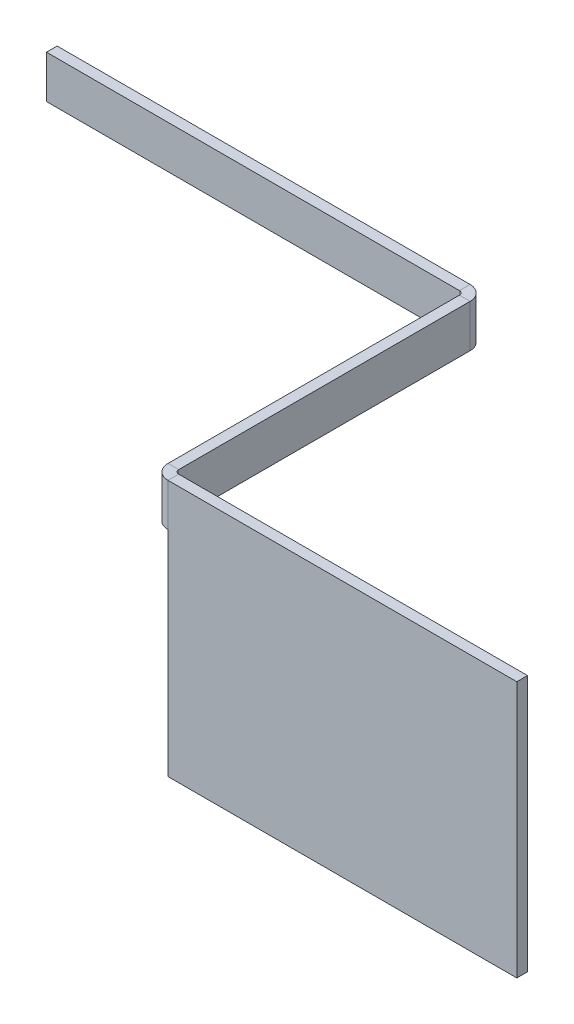
ISO-10303-21;
HEADER;
FILE_DESCRIPTION(('STEP AP214'),'2;1');
FILE_NAME('part.step','',(''),(''),'','','');
FILE_SCHEMA(('AUTOMOTIVE_DESIGN { 1 0 10303 214 1 1 1 1 }'));
ENDSEC;
DATA;
#1=APPLICATION_CONTEXT('core data for automotive mechanical design processes');
#2=APPLICATION_PROTOCOL_DEFINITION('international standard','automotive_design',2000,#1);
#3=PRODUCT_CONTEXT('',#1,'mechanical');
#4=PRODUCT('Part','Part','',(#3));
#5=PRODUCT_RELATED_PRODUCT_CATEGORY('part','',(#4));
#6=PRODUCT_DEFINITION_FORMATION('','',#4);
#7=PRODUCT_DEFINITION_CONTEXT('part definition',#1,'design');
#8=PRODUCT_DEFINITION('design','',#6,#7);
#9=PRODUCT_DEFINITION_SHAPE('','',#8);
#10=(LENGTH_UNIT() NAMED_UNIT(*) SI_UNIT(.MILLI.,.METRE.));
#11=(NAMED_UNIT(*) PLANE_ANGLE_UNIT() SI_UNIT($,.RADIAN.));
#12=(NAMED_UNIT(*) SI_UNIT($,.STERADIAN.) SOLID_ANGLE_UNIT());
#13=UNCERTAINTY_MEASURE_WITH_UNIT(LENGTH_MEASURE(1.E-05),#10,'distance_accuracy_value','');
#14=(GEOMETRIC_REPRESENTATION_CONTEXT(3) GLOBAL_UNCERTAINTY_ASSIGNED_CONTEXT((#13)) GLOBAL_UNIT_ASSIGNED_CONTEXT((#10,
#11,#12)) REPRESENTATION_CONTEXT('',''));
#15=CARTESIAN_POINT('',(0.,0.,0.));
#16=DIRECTION('',(0.,0.,1.));
#17=DIRECTION('',(1.,0.,0.));
#18=AXIS2_PLACEMENT_3D('',#15,#16,#17);
#19=CARTESIAN_POINT('',(-192.923759138241,-73.8089981998545,392.5));
#20=DIRECTION('',(0.,-1.,0.));
#21=DIRECTION('',(0.,0.,-1.));
#22=AXIS2_PLACEMENT_3D('',#19,#20,#21);
#23=PLANE('',#22);
#24=DIRECTION('',(1.,0.,0.));
#25=VECTOR('',#24,1.);
#26=CARTESIAN_POINT('',(-192.923759138241,-73.8089981998545,395.2366));
#27=LINE('',#26,#25);
#28=CARTESIAN_POINT('',(-192.923759138241,-73.8089981998545,395.2366));
#29=VERTEX_POINT('',#28);
#30=CARTESIAN_POINT('',(-190.923759138241,-73.8089981998545,395.2366));
#31=VERTEX_POINT('',#30);
#32=EDGE_CURVE('E270',#29,#31,#27,.T.);
#33=ORIENTED_EDGE('',*,*,#32,.F.);
#34=DIRECTION('',(0.,0.,-1.));
#35=VECTOR('',#34,1.);
#36=CARTESIAN_POINT('',(-192.923759138242,-73.8089981998548,7.7715611723761E-13));
#37=LINE('',#36,#35);
#38=CARTESIAN_POINT('',(-192.923759138241,-73.8089981998544,449.763400000001));
#39=VERTEX_POINT('',#38);
#40=EDGE_CURVE('E102',#39,#29,#37,.T.);
#41=ORIENTED_EDGE('',*,*,#40,.F.);
#42=DIRECTION('',(-1.,0.,0.));
#43=VECTOR('',#42,1.);
#44=CARTESIAN_POINT('',(-190.923759138241,-73.8089981998544,449.763400000001));
#45=LINE('',#44,#43);
#46=CARTESIAN_POINT('',(-190.923759138241,-73.8089981998544,449.763400000001));
#47=VERTEX_POINT('',#46);
#48=EDGE_CURVE('E275',#47,#39,#45,.T.);
#49=ORIENTED_EDGE('',*,*,#48,.F.);
#50=DIRECTION('',(0.,0.,1.));
#51=VECTOR('',#50,1.);
#52=CARTESIAN_POINT('',(-190.923759138241,-73.8089981998545,392.5));
#53=LINE('',#52,#51);
#54=EDGE_CURVE('E259',#47,#31,#53,.F.);
#55=ORIENTED_EDGE('',*,*,#54,.T.);
#56=EDGE_LOOP('',(#33,#41,#49,#55));
#57=FACE_BOUND('',#56,.T.);
#58=ADVANCED_FACE('F78',(#57),#23,.F.);
#59=CARTESIAN_POINT('',(-192.923759138242,0.,6.66133814775094E-13));
#60=DIRECTION('',(1.,0.,0.));
#61=DIRECTION('',(0.,0.,-1.));
#62=AXIS2_PLACEMENT_3D('',#59,#60,#61);
#63=PLANE('',#62);
#64=DIRECTION('',(0.,1.,0.));
#65=VECTOR('',#64,1.);
#66=CARTESIAN_POINT('',(-192.923759138241,-121.808998199854,395.2366));
#67=LINE('',#66,#65);
#68=CARTESIAN_POINT('',(-192.923759138241,-81.8089981998545,395.2366));
#69=VERTEX_POINT('',#68);
#70=EDGE_CURVE('E267',#69,#29,#67,.T.);
#71=ORIENTED_EDGE('',*,*,#70,.F.);
#72=DIRECTION('',(0.,0.,-1.));
#73=VECTOR('',#72,1.);
#74=CARTESIAN_POINT('',(-192.923759138241,-81.8089981998545,452.491244901112));
#75=LINE('',#74,#73);
#76=CARTESIAN_POINT('',(-192.923759138241,-81.8089981998545,449.763400000001));
#77=VERTEX_POINT('',#76);
#78=EDGE_CURVE('E82',#77,#69,#75,.T.);
#79=ORIENTED_EDGE('',*,*,#78,.F.);
#80=DIRECTION('',(0.,-1.,0.));
#81=VECTOR('',#80,1.);
#82=CARTESIAN_POINT('',(-192.923759138241,-121.808998199854,449.763400000001));
#83=LINE('',#82,#81);
#84=EDGE_CURVE('E87',#39,#77,#83,.T.);
#85=ORIENTED_EDGE('',*,*,#84,.F.);
#86=ORIENTED_EDGE('',*,*,#40,.T.);
#87=EDGE_LOOP('',(#71,#79,#85,#86));
#88=FACE_BOUND('',#87,.T.);
#89=ADVANCED_FACE('F283',(#88),#63,.F.);
#90=CARTESIAN_POINT('',(-190.923759138242,0.,6.66133814775094E-13));
#91=DIRECTION('',(1.,0.,0.));
#92=DIRECTION('',(0.,0.,-1.));
#93=AXIS2_PLACEMENT_3D('',#90,#91,#92);
#94=PLANE('',#93);
#95=DIRECTION('',(0.,0.,1.));
#96=VECTOR('',#95,1.);
#97=CARTESIAN_POINT('',(-190.923759138241,-81.8089981998545,452.491244901112));
#98=LINE('',#97,#96);
#99=CARTESIAN_POINT('',(-190.923759138241,-81.8089981998545,395.2366));
#100=VERTEX_POINT('',#99);
#101=CARTESIAN_POINT('',(-190.923759138241,-81.8089981998545,449.763400000001));
#102=VERTEX_POINT('',#101);
#103=EDGE_CURVE('E261',#100,#102,#98,.T.);
#104=ORIENTED_EDGE('',*,*,#103,.F.);
#105=DIRECTION('',(0.,1.,0.));
#106=VECTOR('',#105,1.);
#107=CARTESIAN_POINT('',(-190.923759138241,-121.808998199854,395.2366));
#108=LINE('',#107,#106);
#109=EDGE_CURVE('E258',#100,#31,#108,.T.);
#110=ORIENTED_EDGE('',*,*,#109,.T.);
#111=ORIENTED_EDGE('',*,*,#54,.F.);
#112=DIRECTION('',(0.,1.,0.));
#113=VECTOR('',#112,1.);
#114=CARTESIAN_POINT('',(-190.923759138241,-121.808998199854,449.763400000001));
#115=LINE('',#114,#113);
#116=EDGE_CURVE('E273',#102,#47,#115,.T.);
#117=ORIENTED_EDGE('',*,*,#116,.F.);
#118=EDGE_LOOP('',(#104,#110,#111,#117));
#119=FACE_BOUND('',#118,.T.);
#120=ADVANCED_FACE('F314',(#119),#94,.T.);
#121=CARTESIAN_POINT('',(-47.9677020171653,-81.8089981998545,452.491244901113));
#122=DIRECTION('',(0.,1.,0.));
#123=DIRECTION('',(0.,0.,-1.));
#124=AXIS2_PLACEMENT_3D('',#121,#122,#123);
#125=PLANE('',#124);
#126=DIRECTION('',(1.,0.,0.));
#127=VECTOR('',#126,1.);
#128=CARTESIAN_POINT('',(-192.923759138241,-81.8089981998545,449.763400000001));
#129=LINE('',#128,#127);
#130=EDGE_CURVE('E13',#77,#102,#129,.T.);
#131=ORIENTED_EDGE('',*,*,#130,.F.);
#132=ORIENTED_EDGE('',*,*,#78,.T.);
#133=DIRECTION('',(-1.,0.,0.));
#134=VECTOR('',#133,1.);
#135=CARTESIAN_POINT('',(-190.923759138241,-81.8089981998545,395.2366));
#136=LINE('',#135,#134);
#137=EDGE_CURVE('E264',#100,#69,#136,.T.);
#138=ORIENTED_EDGE('',*,*,#137,.F.);
#139=ORIENTED_EDGE('',*,*,#103,.T.);
#140=EDGE_LOOP('',(#131,#132,#138,#139));
#141=FACE_BOUND('',#140,.T.);
#142=ADVANCED_FACE('F80',(#141),#125,.F.);
#143=CARTESIAN_POINT('',(-193.660359138241,-81.8089981998545,395.2366));
#144=DIRECTION('',(0.,-1.,0.));
#145=DIRECTION('',(1.,0.,0.));
#146=AXIS2_PLACEMENT_3D('',#143,#144,#145);
#147=PLANE('',#146);
#148=ORIENTED_EDGE('',*,*,#137,.T.);
#149=CARTESIAN_POINT('',(-193.660359138241,-81.8089981998545,395.2366));
#150=DIRECTION('',(0.,1.,0.));
#151=DIRECTION('',(-1.,0.,0.));
#152=AXIS2_PLACEMENT_3D('',#149,#150,#151);
#153=CIRCLE('',#152,0.7366);
#154=CARTESIAN_POINT('',(-193.660359138241,-81.8089981998545,394.5));
#155=VERTEX_POINT('',#154);
#156=EDGE_CURVE('E217',#69,#155,#153,.T.);
#157=ORIENTED_EDGE('',*,*,#156,.T.);
#158=DIRECTION('',(0.,0.,-1.));
#159=VECTOR('',#158,1.);
#160=CARTESIAN_POINT('',(-193.660359138241,-81.8089981998545,394.5));
#161=LINE('',#160,#159);
#162=CARTESIAN_POINT('',(-193.660359138241,-81.8089981998545,392.5));
#163=VERTEX_POINT('',#162);
#164=EDGE_CURVE('E237',#155,#163,#161,.T.);
#165=ORIENTED_EDGE('',*,*,#164,.T.);
#166=CARTESIAN_POINT('',(-193.660359138241,-81.8089981998545,395.2366));
#167=DIRECTION('',(0.,1.,0.));
#168=DIRECTION('',(1.,0.,0.));
#169=AXIS2_PLACEMENT_3D('',#166,#167,#168);
#170=CIRCLE('',#169,2.73659999999999);
#171=EDGE_CURVE('E246',#100,#163,#170,.T.);
#172=ORIENTED_EDGE('',*,*,#171,.F.);
#173=EDGE_LOOP('',(#148,#157,#165,#172));
#174=FACE_BOUND('',#173,.T.);
#175=ADVANCED_FACE('F288',(#174),#147,.T.);
#176=CARTESIAN_POINT('',(-193.660359138241,-73.8089981998545,395.2366));
#177=DIRECTION('',(0.,1.,0.));
#178=DIRECTION('',(-1.,0.,0.));
#179=AXIS2_PLACEMENT_3D('',#176,#177,#178);
#180=PLANE('',#179);
#181=DIRECTION('',(0.,0.,-1.));
#182=VECTOR('',#181,1.);
#183=CARTESIAN_POINT('',(-193.660359138241,-73.8089981998545,392.5));
#184=LINE('',#183,#182);
#185=CARTESIAN_POINT('',(-193.660359138241,-73.8089981998545,394.5));
#186=VERTEX_POINT('',#185);
#187=CARTESIAN_POINT('',(-193.660359138241,-73.8089981998545,392.5));
#188=VERTEX_POINT('',#187);
#189=EDGE_CURVE('E221',#186,#188,#184,.T.);
#190=ORIENTED_EDGE('',*,*,#189,.F.);
#191=CARTESIAN_POINT('',(-193.660359138241,-73.8089981998545,395.2366));
#192=DIRECTION('',(0.,1.,0.));
#193=DIRECTION('',(-1.,0.,0.));
#194=AXIS2_PLACEMENT_3D('',#191,#192,#193);
#195=CIRCLE('',#194,0.7366);
#196=EDGE_CURVE('E250',#186,#29,#195,.F.);
#197=ORIENTED_EDGE('',*,*,#196,.T.);
#198=ORIENTED_EDGE('',*,*,#32,.T.);
#199=CARTESIAN_POINT('',(-193.660359138241,-73.8089981998545,395.2366));
#200=DIRECTION('',(0.,-1.,0.));
#201=DIRECTION('',(1.,0.,0.));
#202=AXIS2_PLACEMENT_3D('',#199,#200,#201);
#203=CIRCLE('',#202,2.73659999999999);
#204=EDGE_CURVE('E249',#188,#31,#203,.T.);
#205=ORIENTED_EDGE('',*,*,#204,.F.);
#206=EDGE_LOOP('',(#190,#197,#198,#205));
#207=FACE_BOUND('',#206,.T.);
#208=ADVANCED_FACE('F300',(#207),#180,.T.);
#209=CARTESIAN_POINT('',(-193.660359138241,-86.4946839991753,395.2366));
#210=DIRECTION('',(0.,1.,0.));
#211=DIRECTION('',(-1.,0.,0.));
#212=AXIS2_PLACEMENT_3D('',#209,#210,#211);
#213=CYLINDRICAL_SURFACE('',#212,2.7366);
#214=ORIENTED_EDGE('',*,*,#204,.T.);
#215=ORIENTED_EDGE('',*,*,#109,.F.);
#216=ORIENTED_EDGE('',*,*,#171,.T.);
#217=DIRECTION('',(0.,1.,0.));
#218=VECTOR('',#217,1.);
#219=CARTESIAN_POINT('',(-193.660359138241,-73.8089981998545,392.5));
#220=LINE('',#219,#218);
#221=EDGE_CURVE('E243',#163,#188,#220,.T.);
#222=ORIENTED_EDGE('',*,*,#221,.T.);
#223=EDGE_LOOP('',(#214,#215,#216,#222));
#224=FACE_BOUND('',#223,.T.);
#225=ADVANCED_FACE('F311',(#224),#213,.T.);
#226=CARTESIAN_POINT('',(-193.660359138241,-86.4946839991753,395.2366));
#227=DIRECTION('',(0.,1.,0.));
#228=DIRECTION('',(-1.,0.,0.));
#229=AXIS2_PLACEMENT_3D('',#226,#227,#228);
#230=CYLINDRICAL_SURFACE('',#229,0.7366);
#231=ORIENTED_EDGE('',*,*,#196,.F.);
#232=DIRECTION('',(0.,-1.,0.));
#233=VECTOR('',#232,1.);
#234=CARTESIAN_POINT('',(-193.660359138241,-73.8089981998545,394.5));
#235=LINE('',#234,#233);
#236=EDGE_CURVE('E240',#186,#155,#235,.T.);
#237=ORIENTED_EDGE('',*,*,#236,.T.);
#238=ORIENTED_EDGE('',*,*,#156,.F.);
#239=ORIENTED_EDGE('',*,*,#70,.T.);
#240=EDGE_LOOP('',(#231,#237,#238,#239));
#241=FACE_BOUND('',#240,.T.);
#242=ADVANCED_FACE('F290',(#241),#230,.F.);
#243=CARTESIAN_POINT('',(-270.923759138241,-73.8089981998545,392.5));
#244=DIRECTION('',(1.,0.,0.));
#245=DIRECTION('',(0.,0.,-1.));
#246=AXIS2_PLACEMENT_3D('',#243,#244,#245);
#247=PLANE('',#246);
#248=DIRECTION('',(0.,1.,0.));
#249=VECTOR('',#248,1.);
#250=CARTESIAN_POINT('',(-270.923759138241,0.,392.5));
#251=LINE('',#250,#249);
#252=CARTESIAN_POINT('',(-270.923759138241,-81.8089981998545,392.5));
#253=VERTEX_POINT('',#252);
#254=CARTESIAN_POINT('',(-270.923759138241,-73.8089981998545,392.5));
#255=VERTEX_POINT('',#254);
#256=EDGE_CURVE('E230',#253,#255,#251,.T.);
#257=ORIENTED_EDGE('',*,*,#256,.F.);
#258=DIRECTION('',(0.,0.,1.));
#259=VECTOR('',#258,1.);
#260=CARTESIAN_POINT('',(-270.923759138241,-81.8089981998545,249.543942878925));
#261=LINE('',#260,#259);
#262=CARTESIAN_POINT('',(-270.923759138241,-81.8089981998545,394.5));
#263=VERTEX_POINT('',#262);
#264=EDGE_CURVE('E234',#253,#263,#261,.T.);
#265=ORIENTED_EDGE('',*,*,#264,.T.);
#266=DIRECTION('',(0.,-1.,0.));
#267=VECTOR('',#266,1.);
#268=CARTESIAN_POINT('',(-270.923759138241,-73.8089981998545,394.5));
#269=LINE('',#268,#267);
#270=CARTESIAN_POINT('',(-270.923759138241,-73.8089981998545,394.5));
#271=VERTEX_POINT('',#270);
#272=EDGE_CURVE('E232',#263,#271,#269,.F.);
#273=ORIENTED_EDGE('',*,*,#272,.T.);
#274=DIRECTION('',(0.,0.,1.));
#275=VECTOR('',#274,1.);
#276=CARTESIAN_POINT('',(-270.923759138241,-73.8089981998545,392.5));
#277=LINE('',#276,#275);
#278=EDGE_CURVE('E218',#255,#271,#277,.T.);
#279=ORIENTED_EDGE('',*,*,#278,.F.);
#280=EDGE_LOOP('',(#257,#265,#273,#279));
#281=FACE_BOUND('',#280,.T.);
#282=ADVANCED_FACE('F381',(#281),#247,.F.);
#283=CARTESIAN_POINT('',(0.,0.,392.5));
#284=DIRECTION('',(0.,0.,1.));
#285=DIRECTION('',(1.,0.,0.));
#286=AXIS2_PLACEMENT_3D('',#283,#284,#285);
#287=PLANE('',#286);
#288=ORIENTED_EDGE('',*,*,#221,.F.);
#289=DIRECTION('',(1.,0.,0.));
#290=VECTOR('',#289,1.);
#291=CARTESIAN_POINT('',(-133.677869336017,-81.8089981998545,392.5));
#292=LINE('',#291,#290);
#293=EDGE_CURVE('E223',#253,#163,#292,.T.);
#294=ORIENTED_EDGE('',*,*,#293,.F.);
#295=ORIENTED_EDGE('',*,*,#256,.T.);
#296=DIRECTION('',(1.,0.,0.));
#297=VECTOR('',#296,1.);
#298=CARTESIAN_POINT('',(0.,-73.8089981998545,392.5));
#299=LINE('',#298,#297);
#300=EDGE_CURVE('E227',#255,#188,#299,.T.);
#301=ORIENTED_EDGE('',*,*,#300,.T.);
#302=EDGE_LOOP('',(#288,#294,#295,#301));
#303=FACE_BOUND('',#302,.T.);
#304=ADVANCED_FACE('F306',(#303),#287,.F.);
#305=CARTESIAN_POINT('',(-133.677869336017,-81.8089981998545,249.543942878925));
#306=DIRECTION('',(0.,1.,0.));
#307=DIRECTION('',(-1.,0.,0.));
#308=AXIS2_PLACEMENT_3D('',#305,#306,#307);
#309=PLANE('',#308);
#310=ORIENTED_EDGE('',*,*,#164,.F.);
#311=DIRECTION('',(-1.,0.,0.));
#312=VECTOR('',#311,1.);
#313=CARTESIAN_POINT('',(-133.677869336017,-81.8089981998545,394.5));
#314=LINE('',#313,#312);
#315=EDGE_CURVE('E225',#155,#263,#314,.T.);
#316=ORIENTED_EDGE('',*,*,#315,.T.);
#317=ORIENTED_EDGE('',*,*,#264,.F.);
#318=ORIENTED_EDGE('',*,*,#293,.T.);
#319=EDGE_LOOP('',(#310,#316,#317,#318));
#320=FACE_BOUND('',#319,.T.);
#321=ADVANCED_FACE('F388',(#320),#309,.F.);
#322=CARTESIAN_POINT('',(0.,0.,394.5));
#323=DIRECTION('',(0.,0.,1.));
#324=DIRECTION('',(1.,0.,0.));
#325=AXIS2_PLACEMENT_3D('',#322,#323,#324);
#326=PLANE('',#325);
#327=ORIENTED_EDGE('',*,*,#315,.F.);
#328=ORIENTED_EDGE('',*,*,#236,.F.);
#329=DIRECTION('',(-1.,0.,0.));
#330=VECTOR('',#329,1.);
#331=CARTESIAN_POINT('',(-192.923759138241,-73.8089981998545,394.5));
#332=LINE('',#331,#330);
#333=EDGE_CURVE('E215',#271,#186,#332,.F.);
#334=ORIENTED_EDGE('',*,*,#333,.F.);
#335=ORIENTED_EDGE('',*,*,#272,.F.);
#336=EDGE_LOOP('',(#327,#328,#334,#335));
#337=FACE_BOUND('',#336,.T.);
#338=ADVANCED_FACE('F295',(#337),#326,.T.);
#339=CARTESIAN_POINT('',(-192.923759138241,-73.8089981998545,392.5));
#340=DIRECTION('',(0.,-1.,0.));
#341=DIRECTION('',(0.,0.,-1.));
#342=AXIS2_PLACEMENT_3D('',#339,#340,#341);
#343=PLANE('',#342);
#344=ORIENTED_EDGE('',*,*,#189,.T.);
#345=ORIENTED_EDGE('',*,*,#300,.F.);
#346=ORIENTED_EDGE('',*,*,#278,.T.);
#347=ORIENTED_EDGE('',*,*,#333,.T.);
#348=EDGE_LOOP('',(#344,#345,#346,#347));
#349=FACE_BOUND('',#348,.T.);
#350=ADVANCED_FACE('F303',(#349),#343,.F.);
#351=CARTESIAN_POINT('',(-124.923759138241,-121.808998199854,450.5));
#352=DIRECTION('',(0.,-1.,0.));
#353=DIRECTION('',(1.,0.,0.));
#354=AXIS2_PLACEMENT_3D('',#351,#352,#353);
#355=PLANE('',#354);
#356=DIRECTION('',(0.,0.,1.));
#357=VECTOR('',#356,1.);
#358=CARTESIAN_POINT('',(-190.187159138241,-121.808998199854,450.5));
#359=LINE('',#358,#357);
#360=CARTESIAN_POINT('',(-190.187159138241,-121.808998199854,450.500000000001));
#361=VERTEX_POINT('',#360);
#362=CARTESIAN_POINT('',(-190.187159138241,-121.808998199854,452.500000000001));
#363=VERTEX_POINT('',#362);
#364=EDGE_CURVE('E202',#361,#363,#359,.T.);
#365=ORIENTED_EDGE('',*,*,#364,.F.);
#366=DIRECTION('',(1.,0.,0.));
#367=VECTOR('',#366,1.);
#368=CARTESIAN_POINT('',(-124.923759138241,-121.808998199854,450.5));
#369=LINE('',#368,#367);
#370=CARTESIAN_POINT('',(-124.923759138241,-121.808998199854,450.5));
#371=VERTEX_POINT('',#370);
#372=EDGE_CURVE('E199',#361,#371,#369,.T.);
#373=ORIENTED_EDGE('',*,*,#372,.T.);
#374=DIRECTION('',(0.,0.,1.));
#375=VECTOR('',#374,1.);
#376=CARTESIAN_POINT('',(-124.923759138241,-121.808998199854,450.5));
#377=LINE('',#376,#375);
#378=CARTESIAN_POINT('',(-124.923759138241,-121.808998199854,452.5));
#379=VERTEX_POINT('',#378);
#380=EDGE_CURVE('E211',#371,#379,#377,.T.);
#381=ORIENTED_EDGE('',*,*,#380,.T.);
#382=DIRECTION('',(1.,0.,0.));
#383=VECTOR('',#382,1.);
#384=CARTESIAN_POINT('',(-124.923759138241,-121.808998199854,452.5));
#385=LINE('',#384,#383);
#386=EDGE_CURVE('E332',#363,#379,#385,.T.);
#387=ORIENTED_EDGE('',*,*,#386,.F.);
#388=EDGE_LOOP('',(#365,#373,#381,#387));
#389=FACE_BOUND('',#388,.T.);
#390=ADVANCED_FACE('F351',(#389),#355,.T.);
#391=CARTESIAN_POINT('',(-124.923759138241,-121.808998199854,450.5));
#392=DIRECTION('',(1.,0.,0.));
#393=DIRECTION('',(0.,0.,-1.));
#394=AXIS2_PLACEMENT_3D('',#391,#392,#393);
#395=PLANE('',#394);
#396=DIRECTION('',(0.,1.,0.));
#397=VECTOR('',#396,1.);
#398=CARTESIAN_POINT('',(-124.923759138241,-121.808998199854,452.5));
#399=LINE('',#398,#397);
#400=CARTESIAN_POINT('',(-124.923759138241,-73.8089981998544,452.5));
#401=VERTEX_POINT('',#400);
#402=EDGE_CURVE('E203',#379,#401,#399,.T.);
#403=ORIENTED_EDGE('',*,*,#402,.F.);
#404=ORIENTED_EDGE('',*,*,#380,.F.);
#405=DIRECTION('',(0.,1.,0.));
#406=VECTOR('',#405,1.);
#407=CARTESIAN_POINT('',(-124.923759138241,-121.808998199854,450.5));
#408=LINE('',#407,#406);
#409=CARTESIAN_POINT('',(-124.923759138241,-73.8089981998544,450.5));
#410=VERTEX_POINT('',#409);
#411=EDGE_CURVE('E344',#371,#410,#408,.T.);
#412=ORIENTED_EDGE('',*,*,#411,.T.);
#413=DIRECTION('',(0.,0.,1.));
#414=VECTOR('',#413,1.);
#415=CARTESIAN_POINT('',(-124.923759138241,-73.8089981998544,450.5));
#416=LINE('',#415,#414);
#417=EDGE_CURVE('E342',#410,#401,#416,.T.);
#418=ORIENTED_EDGE('',*,*,#417,.T.);
#419=EDGE_LOOP('',(#403,#404,#412,#418));
#420=FACE_BOUND('',#419,.T.);
#421=ADVANCED_FACE('F353',(#420),#395,.T.);
#422=CARTESIAN_POINT('',(0.,0.,450.5));
#423=DIRECTION('',(0.,0.,1.));
#424=DIRECTION('',(1.,0.,0.));
#425=AXIS2_PLACEMENT_3D('',#422,#423,#424);
#426=PLANE('',#425);
#427=DIRECTION('',(0.,-1.,0.));
#428=VECTOR('',#427,1.);
#429=CARTESIAN_POINT('',(-190.187159138241,-73.8089981998544,450.5));
#430=LINE('',#429,#428);
#431=CARTESIAN_POINT('',(-190.187159138241,-73.8089981998544,450.5));
#432=VERTEX_POINT('',#431);
#433=CARTESIAN_POINT('',(-190.187159138241,-81.8089981998545,450.5));
#434=VERTEX_POINT('',#433);
#435=EDGE_CURVE('E187',#432,#434,#430,.T.);
#436=ORIENTED_EDGE('',*,*,#435,.F.);
#437=DIRECTION('',(-1.,0.,0.));
#438=VECTOR('',#437,1.);
#439=CARTESIAN_POINT('',(-124.923759138241,-73.8089981998544,450.5));
#440=LINE('',#439,#438);
#441=EDGE_CURVE('E340',#410,#432,#440,.T.);
#442=ORIENTED_EDGE('',*,*,#441,.F.);
#443=ORIENTED_EDGE('',*,*,#411,.F.);
#444=ORIENTED_EDGE('',*,*,#372,.F.);
#445=DIRECTION('',(0.,-1.,0.));
#446=VECTOR('',#445,1.);
#447=CARTESIAN_POINT('',(-190.187159138241,-121.808998199854,450.500000000001));
#448=LINE('',#447,#446);
#449=EDGE_CURVE('E196',#434,#361,#448,.T.);
#450=ORIENTED_EDGE('',*,*,#449,.F.);
#451=EDGE_LOOP('',(#436,#442,#443,#444,#450));
#452=FACE_BOUND('',#451,.T.);
#453=ADVANCED_FACE('F197',(#452),#426,.F.);
#454=CARTESIAN_POINT('',(-124.923759138241,-73.8089981998544,450.5));
#455=DIRECTION('',(0.,1.,0.));
#456=DIRECTION('',(-1.,0.,0.));
#457=AXIS2_PLACEMENT_3D('',#454,#455,#456);
#458=PLANE('',#457);
#459=ORIENTED_EDGE('',*,*,#441,.T.);
#460=DIRECTION('',(0.,0.,1.));
#461=VECTOR('',#460,1.);
#462=CARTESIAN_POINT('',(-190.187159138241,-73.8089981998544,450.5));
#463=LINE('',#462,#461);
#464=CARTESIAN_POINT('',(-190.187159138241,-73.8089981998544,452.5));
#465=VERTEX_POINT('',#464);
#466=EDGE_CURVE('E337',#432,#465,#463,.T.);
#467=ORIENTED_EDGE('',*,*,#466,.T.);
#468=DIRECTION('',(-1.,0.,0.));
#469=VECTOR('',#468,1.);
#470=CARTESIAN_POINT('',(-124.923759138241,-73.8089981998544,452.5));
#471=LINE('',#470,#469);
#472=EDGE_CURVE('E335',#401,#465,#471,.T.);
#473=ORIENTED_EDGE('',*,*,#472,.F.);
#474=ORIENTED_EDGE('',*,*,#417,.F.);
#475=EDGE_LOOP('',(#459,#467,#473,#474));
#476=FACE_BOUND('',#475,.T.);
#477=ADVANCED_FACE('F358',(#476),#458,.T.);
#478=CARTESIAN_POINT('',(0.,0.,452.5));
#479=DIRECTION('',(0.,0.,1.));
#480=DIRECTION('',(1.,0.,0.));
#481=AXIS2_PLACEMENT_3D('',#478,#479,#480);
#482=PLANE('',#481);
#483=ORIENTED_EDGE('',*,*,#472,.T.);
#484=DIRECTION('',(0.,-1.,0.));
#485=VECTOR('',#484,1.);
#486=CARTESIAN_POINT('',(-190.187159138241,-73.8089981998544,452.5));
#487=LINE('',#486,#485);
#488=CARTESIAN_POINT('',(-190.187159138241,-81.8089981998545,452.5));
#489=VERTEX_POINT('',#488);
#490=EDGE_CURVE('E322',#465,#489,#487,.T.);
#491=ORIENTED_EDGE('',*,*,#490,.T.);
#492=DIRECTION('',(0.,1.,0.));
#493=VECTOR('',#492,1.);
#494=CARTESIAN_POINT('',(-190.187159138241,-121.808998199854,452.500000000001));
#495=LINE('',#494,#493);
#496=EDGE_CURVE('E208',#363,#489,#495,.T.);
#497=ORIENTED_EDGE('',*,*,#496,.F.);
#498=ORIENTED_EDGE('',*,*,#386,.T.);
#499=ORIENTED_EDGE('',*,*,#402,.T.);
#500=EDGE_LOOP('',(#483,#491,#497,#498,#499));
#501=FACE_BOUND('',#500,.T.);
#502=ADVANCED_FACE('F356',(#501),#482,.T.);
#503=CARTESIAN_POINT('',(-190.187159138241,-121.808998199854,307.543942878925));
#504=DIRECTION('',(1.,0.,0.));
#505=DIRECTION('',(0.,0.,-1.));
#506=AXIS2_PLACEMENT_3D('',#503,#504,#505);
#507=PLANE('',#506);
#508=ORIENTED_EDGE('',*,*,#449,.T.);
#509=ORIENTED_EDGE('',*,*,#364,.T.);
#510=ORIENTED_EDGE('',*,*,#496,.T.);
#511=DIRECTION('',(0.,0.,1.));
#512=VECTOR('',#511,1.);
#513=CARTESIAN_POINT('',(-190.187159138241,-81.8089981998545,307.543942878925));
#514=LINE('',#513,#512);
#515=EDGE_CURVE('E178',#434,#489,#514,.T.);
#516=ORIENTED_EDGE('',*,*,#515,.F.);
#517=EDGE_LOOP('',(#508,#509,#510,#516));
#518=FACE_BOUND('',#517,.T.);
#519=ADVANCED_FACE('F206',(#518),#507,.F.);
#520=CARTESIAN_POINT('',(-190.187159138241,-81.8089981998545,449.763400000001));
#521=DIRECTION('',(0.,1.,0.));
#522=DIRECTION('',(0.,0.,1.));
#523=AXIS2_PLACEMENT_3D('',#520,#521,#522);
#524=PLANE('',#523);
#525=ORIENTED_EDGE('',*,*,#515,.T.);
#526=CARTESIAN_POINT('',(-190.187159138241,-81.8089981998545,449.763400000001));
#527=DIRECTION('',(0.,1.,0.));
#528=DIRECTION('',(0.,0.,1.));
#529=AXIS2_PLACEMENT_3D('',#526,#527,#528);
#530=CIRCLE('',#529,2.7366);
#531=EDGE_CURVE('E323',#489,#77,#530,.F.);
#532=ORIENTED_EDGE('',*,*,#531,.T.);
#533=ORIENTED_EDGE('',*,*,#130,.T.);
#534=CARTESIAN_POINT('',(-190.187159138241,-81.8089981998545,449.763400000001));
#535=DIRECTION('',(0.,-1.,0.));
#536=DIRECTION('',(0.,0.,1.));
#537=AXIS2_PLACEMENT_3D('',#534,#535,#536);
#538=CIRCLE('',#537,0.73659999999999);
#539=EDGE_CURVE('E173',#434,#102,#538,.T.);
#540=ORIENTED_EDGE('',*,*,#539,.F.);
#541=EDGE_LOOP('',(#525,#532,#533,#540));
#542=FACE_BOUND('',#541,.T.);
#543=ADVANCED_FACE('F175',(#542),#524,.F.);
#544=CARTESIAN_POINT('',(-190.187159138241,-73.8089981998544,449.763400000001));
#545=DIRECTION('',(0.,-1.,0.));
#546=DIRECTION('',(0.,0.,-1.));
#547=AXIS2_PLACEMENT_3D('',#544,#545,#546);
#548=PLANE('',#547);
#549=ORIENTED_EDGE('',*,*,#48,.T.);
#550=CARTESIAN_POINT('',(-190.187159138241,-73.8089981998544,449.763400000001));
#551=DIRECTION('',(0.,1.,0.));
#552=DIRECTION('',(0.,0.,1.));
#553=AXIS2_PLACEMENT_3D('',#550,#551,#552);
#554=CIRCLE('',#553,2.7366);
#555=EDGE_CURVE('E183',#39,#465,#554,.T.);
#556=ORIENTED_EDGE('',*,*,#555,.T.);
#557=ORIENTED_EDGE('',*,*,#466,.F.);
#558=CARTESIAN_POINT('',(-190.187159138241,-73.8089981998544,449.763400000001));
#559=DIRECTION('',(0.,1.,0.));
#560=DIRECTION('',(0.,0.,1.));
#561=AXIS2_PLACEMENT_3D('',#558,#559,#560);
#562=CIRCLE('',#561,0.73659999999999);
#563=EDGE_CURVE('E182',#47,#432,#562,.T.);
#564=ORIENTED_EDGE('',*,*,#563,.F.);
#565=EDGE_LOOP('',(#549,#556,#557,#564));
#566=FACE_BOUND('',#565,.T.);
#567=ADVANCED_FACE('F318',(#566),#548,.F.);
#568=CARTESIAN_POINT('',(-190.187159138241,-86.4946839991754,449.763400000001));
#569=DIRECTION('',(0.,1.,0.));
#570=DIRECTION('',(0.,0.,1.));
#571=AXIS2_PLACEMENT_3D('',#568,#569,#570);
#572=CYLINDRICAL_SURFACE('',#571,0.7366);
#573=ORIENTED_EDGE('',*,*,#563,.T.);
#574=ORIENTED_EDGE('',*,*,#435,.T.);
#575=ORIENTED_EDGE('',*,*,#539,.T.);
#576=ORIENTED_EDGE('',*,*,#116,.T.);
#577=EDGE_LOOP('',(#573,#574,#575,#576));
#578=FACE_BOUND('',#577,.T.);
#579=ADVANCED_FACE('F189',(#578),#572,.F.);
#580=CARTESIAN_POINT('',(-190.187159138241,-86.4946839991754,449.763400000001));
#581=DIRECTION('',(0.,1.,0.));
#582=DIRECTION('',(0.,0.,1.));
#583=AXIS2_PLACEMENT_3D('',#580,#581,#582);
#584=CYLINDRICAL_SURFACE('',#583,2.7366);
#585=ORIENTED_EDGE('',*,*,#555,.F.);
#586=ORIENTED_EDGE('',*,*,#84,.T.);
#587=ORIENTED_EDGE('',*,*,#531,.F.);
#588=ORIENTED_EDGE('',*,*,#490,.F.);
#589=EDGE_LOOP('',(#585,#586,#587,#588));
#590=FACE_BOUND('',#589,.T.);
#591=ADVANCED_FACE('F321',(#590),#584,.T.);
#592=CLOSED_SHELL('',(#58,#89,#120,#142,#175,#208,#225,#242,#282,#304,#321,#338,#350,#390,#421,
#453,#477,#502,#519,#543,#567,#579,#591));
#593=MANIFOLD_SOLID_BREP('B2',#592);
#594=ADVANCED_BREP_SHAPE_REPRESENTATION('',(#18,#593),#14);
#595=SHAPE_DEFINITION_REPRESENTATION(#9,#594);
ENDSEC;
END-ISO-10303-21;
